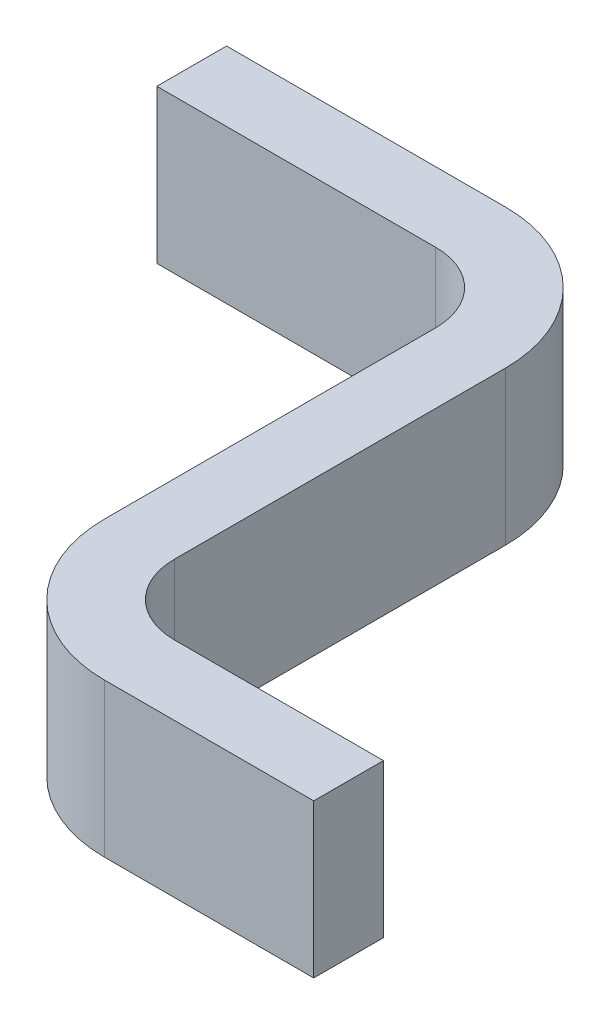
ISO-10303-21;
HEADER;
FILE_DESCRIPTION(('STEP AP214'),'2;1');
FILE_NAME('part.step','',(''),(''),'','','');
FILE_SCHEMA(('AUTOMOTIVE_DESIGN { 1 0 10303 214 1 1 1 1 }'));
ENDSEC;
DATA;
#1=APPLICATION_CONTEXT('core data for automotive mechanical design processes');
#2=APPLICATION_PROTOCOL_DEFINITION('international standard','automotive_design',2000,#1);
#3=PRODUCT_CONTEXT('',#1,'mechanical');
#4=PRODUCT('Part','Part','',(#3));
#5=PRODUCT_RELATED_PRODUCT_CATEGORY('part','',(#4));
#6=PRODUCT_DEFINITION_FORMATION('','',#4);
#7=PRODUCT_DEFINITION_CONTEXT('part definition',#1,'design');
#8=PRODUCT_DEFINITION('design','',#6,#7);
#9=PRODUCT_DEFINITION_SHAPE('','',#8);
#10=(LENGTH_UNIT() NAMED_UNIT(*) SI_UNIT(.MILLI.,.METRE.));
#11=(NAMED_UNIT(*) PLANE_ANGLE_UNIT() SI_UNIT($,.RADIAN.));
#12=(NAMED_UNIT(*) SI_UNIT($,.STERADIAN.) SOLID_ANGLE_UNIT());
#13=UNCERTAINTY_MEASURE_WITH_UNIT(LENGTH_MEASURE(1.E-05),#10,'distance_accuracy_value','');
#14=(GEOMETRIC_REPRESENTATION_CONTEXT(3) GLOBAL_UNCERTAINTY_ASSIGNED_CONTEXT((#13)) GLOBAL_UNIT_ASSIGNED_CONTEXT((#10,
#11,#12)) REPRESENTATION_CONTEXT('',''));
#15=CARTESIAN_POINT('',(0.,0.,0.));
#16=DIRECTION('',(0.,0.,1.));
#17=DIRECTION('',(1.,0.,0.));
#18=AXIS2_PLACEMENT_3D('',#15,#16,#17);
#19=CARTESIAN_POINT('',(-4.,-2.64,0.675));
#20=DIRECTION('',(0.,-1.,0.));
#21=DIRECTION('',(1.,0.,0.));
#22=AXIS2_PLACEMENT_3D('',#19,#20,#21);
#23=PLANE('',#22);
#24=CARTESIAN_POINT('',(-3.80000000000001,-2.64000000000001,0.675));
#25=DIRECTION('',(0.,1.,0.));
#26=DIRECTION('',(-1.,0.,0.));
#27=AXIS2_PLACEMENT_3D('',#24,#25,#26);
#28=CIRCLE('',#27,0.2);
#29=CARTESIAN_POINT('',(-3.80000000000001,-2.64000000000001,0.875));
#30=VERTEX_POINT('',#29);
#31=CARTESIAN_POINT('',(-4.,-2.64,0.675));
#32=VERTEX_POINT('',#31);
#33=EDGE_CURVE('E150',#30,#32,#28,.F.);
#34=ORIENTED_EDGE('',*,*,#33,.F.);
#35=DIRECTION('',(-1.,0.,0.));
#36=VECTOR('',#35,1.);
#37=CARTESIAN_POINT('',(-3.5,-2.64,0.875));
#38=LINE('',#37,#36);
#39=CARTESIAN_POINT('',(-3.5,-2.64,0.875));
#40=VERTEX_POINT('',#39);
#41=EDGE_CURVE('E147',#30,#40,#38,.F.);
#42=ORIENTED_EDGE('',*,*,#41,.T.);
#43=DIRECTION('',(0.,0.,1.));
#44=VECTOR('',#43,1.);
#45=CARTESIAN_POINT('',(-3.5,-2.64,0.775));
#46=LINE('',#45,#44);
#47=CARTESIAN_POINT('',(-3.5,-2.64,0.775));
#48=VERTEX_POINT('',#47);
#49=EDGE_CURVE('E141',#48,#40,#46,.T.);
#50=ORIENTED_EDGE('',*,*,#49,.F.);
#51=DIRECTION('',(1.,0.,0.));
#52=VECTOR('',#51,1.);
#53=CARTESIAN_POINT('',(-3.5,-2.64,0.775));
#54=LINE('',#53,#52);
#55=CARTESIAN_POINT('',(-3.80000000000001,-2.64000000000001,0.775));
#56=VERTEX_POINT('',#55);
#57=EDGE_CURVE('E115',#48,#56,#54,.F.);
#58=ORIENTED_EDGE('',*,*,#57,.T.);
#59=CARTESIAN_POINT('',(-3.80000000000001,-2.64000000000001,0.675));
#60=DIRECTION('',(0.,1.,0.));
#61=DIRECTION('',(-1.,0.,0.));
#62=AXIS2_PLACEMENT_3D('',#59,#60,#61);
#63=CIRCLE('',#62,0.1);
#64=CARTESIAN_POINT('',(-3.9,-2.64,0.675));
#65=VERTEX_POINT('',#64);
#66=EDGE_CURVE('E215',#56,#65,#63,.F.);
#67=ORIENTED_EDGE('',*,*,#66,.T.);
#68=DIRECTION('',(0.,0.,1.));
#69=VECTOR('',#68,1.);
#70=CARTESIAN_POINT('',(-3.9,-2.64,0.675));
#71=LINE('',#70,#69);
#72=CARTESIAN_POINT('',(-3.9,-2.64,0.2));
#73=VERTEX_POINT('',#72);
#74=EDGE_CURVE('E181',#65,#73,#71,.F.);
#75=ORIENTED_EDGE('',*,*,#74,.T.);
#76=CARTESIAN_POINT('',(-4.1,-2.64,0.2));
#77=DIRECTION('',(0.,-1.,0.));
#78=DIRECTION('',(1.,0.,0.));
#79=AXIS2_PLACEMENT_3D('',#76,#77,#78);
#80=CIRCLE('',#79,0.2);
#81=CARTESIAN_POINT('',(-4.1,-2.64,0.));
#82=VERTEX_POINT('',#81);
#83=EDGE_CURVE('E20',#82,#73,#80,.T.);
#84=ORIENTED_EDGE('',*,*,#83,.F.);
#85=DIRECTION('',(1.,0.,0.));
#86=VECTOR('',#85,1.);
#87=CARTESIAN_POINT('',(-4.1,-2.64,0.));
#88=LINE('',#87,#86);
#89=CARTESIAN_POINT('',(-4.5,-2.64,0.));
#90=VERTEX_POINT('',#89);
#91=EDGE_CURVE('E91',#82,#90,#88,.F.);
#92=ORIENTED_EDGE('',*,*,#91,.T.);
#93=DIRECTION('',(0.,0.,1.));
#94=VECTOR('',#93,1.);
#95=CARTESIAN_POINT('',(-4.5,-2.64,0.));
#96=LINE('',#95,#94);
#97=CARTESIAN_POINT('',(-4.5,-2.64,0.1));
#98=VERTEX_POINT('',#97);
#99=EDGE_CURVE('E163',#90,#98,#96,.T.);
#100=ORIENTED_EDGE('',*,*,#99,.T.);
#101=DIRECTION('',(-1.,0.,0.));
#102=VECTOR('',#101,1.);
#103=CARTESIAN_POINT('',(-4.1,-2.64,0.1));
#104=LINE('',#103,#102);
#105=CARTESIAN_POINT('',(-4.1,-2.64,0.1));
#106=VERTEX_POINT('',#105);
#107=EDGE_CURVE('E159',#98,#106,#104,.F.);
#108=ORIENTED_EDGE('',*,*,#107,.T.);
#109=CARTESIAN_POINT('',(-4.1,-2.64,0.2));
#110=DIRECTION('',(0.,-1.,0.));
#111=DIRECTION('',(1.,0.,0.));
#112=AXIS2_PLACEMENT_3D('',#109,#110,#111);
#113=CIRCLE('',#112,0.1);
#114=CARTESIAN_POINT('',(-4.,-2.64,0.2));
#115=VERTEX_POINT('',#114);
#116=EDGE_CURVE('E155',#106,#115,#113,.T.);
#117=ORIENTED_EDGE('',*,*,#116,.T.);
#118=DIRECTION('',(0.,0.,1.));
#119=VECTOR('',#118,1.);
#120=CARTESIAN_POINT('',(-4.,-2.64,0.675));
#121=LINE('',#120,#119);
#122=EDGE_CURVE('E154',#115,#32,#121,.T.);
#123=ORIENTED_EDGE('',*,*,#122,.T.);
#124=EDGE_LOOP('',(#34,#42,#50,#58,#67,#75,#84,#92,#100,#108,#117,#123));
#125=FACE_BOUND('',#124,.T.);
#126=ADVANCED_FACE('F17',(#125),#23,.F.);
#127=CARTESIAN_POINT('',(-4.1,-2.64,0.2));
#128=DIRECTION('',(0.,-1.,0.));
#129=DIRECTION('',(1.,0.,0.));
#130=AXIS2_PLACEMENT_3D('',#127,#128,#129);
#131=CYLINDRICAL_SURFACE('',#130,0.2);
#132=CARTESIAN_POINT('',(-4.1,-2.86,0.2));
#133=DIRECTION('',(0.,-1.,0.));
#134=DIRECTION('',(1.,0.,0.));
#135=AXIS2_PLACEMENT_3D('',#132,#133,#134);
#136=CIRCLE('',#135,0.2);
#137=CARTESIAN_POINT('',(-3.9,-2.86,0.2));
#138=VERTEX_POINT('',#137);
#139=CARTESIAN_POINT('',(-4.1,-2.86,0.));
#140=VERTEX_POINT('',#139);
#141=EDGE_CURVE('E183',#138,#140,#136,.F.);
#142=ORIENTED_EDGE('',*,*,#141,.T.);
#143=DIRECTION('',(0.,1.,0.));
#144=VECTOR('',#143,1.);
#145=CARTESIAN_POINT('',(-4.1,-2.64,0.));
#146=LINE('',#145,#144);
#147=EDGE_CURVE('E178',#140,#82,#146,.T.);
#148=ORIENTED_EDGE('',*,*,#147,.T.);
#149=ORIENTED_EDGE('',*,*,#83,.T.);
#150=DIRECTION('',(0.,-1.,0.));
#151=VECTOR('',#150,1.);
#152=CARTESIAN_POINT('',(-3.9,-2.64,0.2));
#153=LINE('',#152,#151);
#154=EDGE_CURVE('E217',#73,#138,#153,.T.);
#155=ORIENTED_EDGE('',*,*,#154,.T.);
#156=EDGE_LOOP('',(#142,#148,#149,#155));
#157=FACE_BOUND('',#156,.T.);
#158=ADVANCED_FACE('F254',(#157),#131,.T.);
#159=CARTESIAN_POINT('',(-4.1,-2.64,0.));
#160=DIRECTION('',(0.,0.,1.));
#161=DIRECTION('',(1.,0.,0.));
#162=AXIS2_PLACEMENT_3D('',#159,#160,#161);
#163=PLANE('',#162);
#164=ORIENTED_EDGE('',*,*,#147,.F.);
#165=DIRECTION('',(-1.,0.,0.));
#166=VECTOR('',#165,1.);
#167=CARTESIAN_POINT('',(-3.9,-2.86,0.));
#168=LINE('',#167,#166);
#169=CARTESIAN_POINT('',(-4.5,-2.86,0.));
#170=VERTEX_POINT('',#169);
#171=EDGE_CURVE('E170',#140,#170,#168,.T.);
#172=ORIENTED_EDGE('',*,*,#171,.T.);
#173=DIRECTION('',(0.,1.,0.));
#174=VECTOR('',#173,1.);
#175=CARTESIAN_POINT('',(-4.5,-2.64,0.));
#176=LINE('',#175,#174);
#177=EDGE_CURVE('E173',#170,#90,#176,.T.);
#178=ORIENTED_EDGE('',*,*,#177,.T.);
#179=ORIENTED_EDGE('',*,*,#91,.F.);
#180=EDGE_LOOP('',(#164,#172,#178,#179));
#181=FACE_BOUND('',#180,.T.);
#182=ADVANCED_FACE('F257',(#181),#163,.F.);
#183=CARTESIAN_POINT('',(-4.5,-2.64,0.));
#184=DIRECTION('',(1.,0.,0.));
#185=DIRECTION('',(0.,1.,0.));
#186=AXIS2_PLACEMENT_3D('',#183,#184,#185);
#187=PLANE('',#186);
#188=DIRECTION('',(0.,1.,0.));
#189=VECTOR('',#188,1.);
#190=CARTESIAN_POINT('',(-4.5,-2.86,0.1));
#191=LINE('',#190,#189);
#192=CARTESIAN_POINT('',(-4.5,-2.86,0.1));
#193=VERTEX_POINT('',#192);
#194=EDGE_CURVE('E160',#193,#98,#191,.T.);
#195=ORIENTED_EDGE('',*,*,#194,.T.);
#196=ORIENTED_EDGE('',*,*,#99,.F.);
#197=ORIENTED_EDGE('',*,*,#177,.F.);
#198=DIRECTION('',(0.,0.,1.));
#199=VECTOR('',#198,1.);
#200=CARTESIAN_POINT('',(-4.5,-2.86,0.675));
#201=LINE('',#200,#199);
#202=EDGE_CURVE('E166',#170,#193,#201,.T.);
#203=ORIENTED_EDGE('',*,*,#202,.T.);
#204=EDGE_LOOP('',(#195,#196,#197,#203));
#205=FACE_BOUND('',#204,.T.);
#206=ADVANCED_FACE('F259',(#205),#187,.F.);
#207=CARTESIAN_POINT('',(-4.1,-2.86,0.1));
#208=DIRECTION('',(0.,0.,-1.));
#209=DIRECTION('',(-1.,0.,0.));
#210=AXIS2_PLACEMENT_3D('',#207,#208,#209);
#211=PLANE('',#210);
#212=DIRECTION('',(0.,-1.,0.));
#213=VECTOR('',#212,1.);
#214=CARTESIAN_POINT('',(-4.1,-2.86,0.1));
#215=LINE('',#214,#213);
#216=CARTESIAN_POINT('',(-4.1,-2.86,0.1));
#217=VERTEX_POINT('',#216);
#218=EDGE_CURVE('E156',#217,#106,#215,.F.);
#219=ORIENTED_EDGE('',*,*,#218,.T.);
#220=ORIENTED_EDGE('',*,*,#107,.F.);
#221=ORIENTED_EDGE('',*,*,#194,.F.);
#222=DIRECTION('',(-1.,0.,0.));
#223=VECTOR('',#222,1.);
#224=CARTESIAN_POINT('',(-3.9,-2.86,0.1));
#225=LINE('',#224,#223);
#226=EDGE_CURVE('E169',#193,#217,#225,.F.);
#227=ORIENTED_EDGE('',*,*,#226,.T.);
#228=EDGE_LOOP('',(#219,#220,#221,#227));
#229=FACE_BOUND('',#228,.T.);
#230=ADVANCED_FACE('F234',(#229),#211,.F.);
#231=CARTESIAN_POINT('',(-4.1,-2.86,0.2));
#232=DIRECTION('',(0.,-1.,0.));
#233=DIRECTION('',(1.,0.,0.));
#234=AXIS2_PLACEMENT_3D('',#231,#232,#233);
#235=CYLINDRICAL_SURFACE('',#234,0.1);
#236=DIRECTION('',(0.,1.,0.));
#237=VECTOR('',#236,1.);
#238=CARTESIAN_POINT('',(-4.,-2.86,0.2));
#239=LINE('',#238,#237);
#240=CARTESIAN_POINT('',(-4.,-2.86,0.2));
#241=VERTEX_POINT('',#240);
#242=EDGE_CURVE('E151',#241,#115,#239,.T.);
#243=ORIENTED_EDGE('',*,*,#242,.T.);
#244=ORIENTED_EDGE('',*,*,#116,.F.);
#245=ORIENTED_EDGE('',*,*,#218,.F.);
#246=CARTESIAN_POINT('',(-4.1,-2.86,0.2));
#247=DIRECTION('',(0.,-1.,0.));
#248=DIRECTION('',(1.,0.,0.));
#249=AXIS2_PLACEMENT_3D('',#246,#247,#248);
#250=CIRCLE('',#249,0.1);
#251=EDGE_CURVE('E210',#217,#241,#250,.T.);
#252=ORIENTED_EDGE('',*,*,#251,.T.);
#253=EDGE_LOOP('',(#243,#244,#245,#252));
#254=FACE_BOUND('',#253,.T.);
#255=ADVANCED_FACE('F227',(#254),#235,.F.);
#256=CARTESIAN_POINT('',(-4.,-2.86,0.675));
#257=DIRECTION('',(1.,0.,0.));
#258=DIRECTION('',(0.,1.,0.));
#259=AXIS2_PLACEMENT_3D('',#256,#257,#258);
#260=PLANE('',#259);
#261=DIRECTION('',(0.,1.,0.));
#262=VECTOR('',#261,1.);
#263=CARTESIAN_POINT('',(-4.,-2.86,0.675));
#264=LINE('',#263,#262);
#265=CARTESIAN_POINT('',(-4.,-2.86,0.675));
#266=VERTEX_POINT('',#265);
#267=EDGE_CURVE('E148',#32,#266,#264,.F.);
#268=ORIENTED_EDGE('',*,*,#267,.F.);
#269=ORIENTED_EDGE('',*,*,#122,.F.);
#270=ORIENTED_EDGE('',*,*,#242,.F.);
#271=DIRECTION('',(0.,0.,1.));
#272=VECTOR('',#271,1.);
#273=CARTESIAN_POINT('',(-4.,-2.86,0.675));
#274=LINE('',#273,#272);
#275=EDGE_CURVE('E209',#241,#266,#274,.T.);
#276=ORIENTED_EDGE('',*,*,#275,.T.);
#277=EDGE_LOOP('',(#268,#269,#270,#276));
#278=FACE_BOUND('',#277,.T.);
#279=ADVANCED_FACE('F224',(#278),#260,.F.);
#280=CARTESIAN_POINT('',(-3.8,-2.86,0.675));
#281=DIRECTION('',(0.,1.,0.));
#282=DIRECTION('',(-1.,0.,0.));
#283=AXIS2_PLACEMENT_3D('',#280,#281,#282);
#284=CYLINDRICAL_SURFACE('',#283,0.2);
#285=ORIENTED_EDGE('',*,*,#33,.T.);
#286=ORIENTED_EDGE('',*,*,#267,.T.);
#287=CARTESIAN_POINT('',(-3.8,-2.86,0.675));
#288=DIRECTION('',(0.,1.,0.));
#289=DIRECTION('',(-1.,0.,0.));
#290=AXIS2_PLACEMENT_3D('',#287,#288,#289);
#291=CIRCLE('',#290,0.2);
#292=CARTESIAN_POINT('',(-3.8,-2.86,0.875));
#293=VERTEX_POINT('',#292);
#294=EDGE_CURVE('E133',#266,#293,#291,.T.);
#295=ORIENTED_EDGE('',*,*,#294,.T.);
#296=DIRECTION('',(0.,1.,0.));
#297=VECTOR('',#296,1.);
#298=CARTESIAN_POINT('',(-3.8,-2.86,0.875));
#299=LINE('',#298,#297);
#300=EDGE_CURVE('E144',#293,#30,#299,.T.);
#301=ORIENTED_EDGE('',*,*,#300,.T.);
#302=EDGE_LOOP('',(#285,#286,#295,#301));
#303=FACE_BOUND('',#302,.T.);
#304=ADVANCED_FACE('F285',(#303),#284,.T.);
#305=CARTESIAN_POINT('',(-3.5,-2.86,0.875));
#306=DIRECTION('',(0.,0.,-1.));
#307=DIRECTION('',(-1.,0.,0.));
#308=AXIS2_PLACEMENT_3D('',#305,#306,#307);
#309=PLANE('',#308);
#310=DIRECTION('',(0.,1.,0.));
#311=VECTOR('',#310,1.);
#312=CARTESIAN_POINT('',(-3.5,-2.64,0.875));
#313=LINE('',#312,#311);
#314=CARTESIAN_POINT('',(-3.5,-2.86,0.875));
#315=VERTEX_POINT('',#314);
#316=EDGE_CURVE('E118',#40,#315,#313,.F.);
#317=ORIENTED_EDGE('',*,*,#316,.F.);
#318=ORIENTED_EDGE('',*,*,#41,.F.);
#319=ORIENTED_EDGE('',*,*,#300,.F.);
#320=DIRECTION('',(-1.,0.,0.));
#321=VECTOR('',#320,1.);
#322=CARTESIAN_POINT('',(-3.9,-2.86,0.875));
#323=LINE('',#322,#321);
#324=EDGE_CURVE('E131',#293,#315,#323,.F.);
#325=ORIENTED_EDGE('',*,*,#324,.T.);
#326=EDGE_LOOP('',(#317,#318,#319,#325));
#327=FACE_BOUND('',#326,.T.);
#328=ADVANCED_FACE('F282',(#327),#309,.F.);
#329=CARTESIAN_POINT('',(-3.5,-2.64,0.775));
#330=DIRECTION('',(1.,0.,0.));
#331=DIRECTION('',(0.,1.,0.));
#332=AXIS2_PLACEMENT_3D('',#329,#330,#331);
#333=PLANE('',#332);
#334=ORIENTED_EDGE('',*,*,#49,.T.);
#335=ORIENTED_EDGE('',*,*,#316,.T.);
#336=DIRECTION('',(0.,0.,1.));
#337=VECTOR('',#336,1.);
#338=CARTESIAN_POINT('',(-3.5,-2.86,0.675));
#339=LINE('',#338,#337);
#340=CARTESIAN_POINT('',(-3.5,-2.86,0.775));
#341=VERTEX_POINT('',#340);
#342=EDGE_CURVE('E125',#315,#341,#339,.F.);
#343=ORIENTED_EDGE('',*,*,#342,.T.);
#344=DIRECTION('',(0.,1.,0.));
#345=VECTOR('',#344,1.);
#346=CARTESIAN_POINT('',(-3.5,-2.64,0.775));
#347=LINE('',#346,#345);
#348=EDGE_CURVE('E110',#341,#48,#347,.T.);
#349=ORIENTED_EDGE('',*,*,#348,.T.);
#350=EDGE_LOOP('',(#334,#335,#343,#349));
#351=FACE_BOUND('',#350,.T.);
#352=ADVANCED_FACE('F129',(#351),#333,.T.);
#353=CARTESIAN_POINT('',(-3.5,-2.64,0.775));
#354=DIRECTION('',(0.,0.,1.));
#355=DIRECTION('',(1.,0.,0.));
#356=AXIS2_PLACEMENT_3D('',#353,#354,#355);
#357=PLANE('',#356);
#358=ORIENTED_EDGE('',*,*,#348,.F.);
#359=DIRECTION('',(-1.,0.,0.));
#360=VECTOR('',#359,1.);
#361=CARTESIAN_POINT('',(-3.9,-2.86,0.775));
#362=LINE('',#361,#360);
#363=CARTESIAN_POINT('',(-3.8,-2.86,0.775));
#364=VERTEX_POINT('',#363);
#365=EDGE_CURVE('E114',#341,#364,#362,.T.);
#366=ORIENTED_EDGE('',*,*,#365,.T.);
#367=DIRECTION('',(0.,1.,0.));
#368=VECTOR('',#367,1.);
#369=CARTESIAN_POINT('',(-3.80000000000001,-2.64000000000001,0.775));
#370=LINE('',#369,#368);
#371=EDGE_CURVE('E185',#364,#56,#370,.T.);
#372=ORIENTED_EDGE('',*,*,#371,.T.);
#373=ORIENTED_EDGE('',*,*,#57,.F.);
#374=EDGE_LOOP('',(#358,#366,#372,#373));
#375=FACE_BOUND('',#374,.T.);
#376=ADVANCED_FACE('F112',(#375),#357,.F.);
#377=CARTESIAN_POINT('',(-3.80000000000001,-2.64000000000001,0.675));
#378=DIRECTION('',(0.,1.,0.));
#379=DIRECTION('',(-1.,0.,0.));
#380=AXIS2_PLACEMENT_3D('',#377,#378,#379);
#381=CYLINDRICAL_SURFACE('',#380,0.1);
#382=ORIENTED_EDGE('',*,*,#371,.F.);
#383=CARTESIAN_POINT('',(-3.8,-2.86,0.675));
#384=DIRECTION('',(0.,1.,0.));
#385=DIRECTION('',(-1.,0.,0.));
#386=AXIS2_PLACEMENT_3D('',#383,#384,#385);
#387=CIRCLE('',#386,0.1);
#388=CARTESIAN_POINT('',(-3.9,-2.86,0.675));
#389=VERTEX_POINT('',#388);
#390=EDGE_CURVE('E26',#364,#389,#387,.F.);
#391=ORIENTED_EDGE('',*,*,#390,.T.);
#392=DIRECTION('',(0.,-1.,0.));
#393=VECTOR('',#392,1.);
#394=CARTESIAN_POINT('',(-3.9,-2.64,0.675));
#395=LINE('',#394,#393);
#396=EDGE_CURVE('E34',#389,#65,#395,.F.);
#397=ORIENTED_EDGE('',*,*,#396,.T.);
#398=ORIENTED_EDGE('',*,*,#66,.F.);
#399=EDGE_LOOP('',(#382,#391,#397,#398));
#400=FACE_BOUND('',#399,.T.);
#401=ADVANCED_FACE('F250',(#400),#381,.F.);
#402=CARTESIAN_POINT('',(-3.9,-2.64,0.675));
#403=DIRECTION('',(-1.,0.,0.));
#404=DIRECTION('',(0.,-1.,0.));
#405=AXIS2_PLACEMENT_3D('',#402,#403,#404);
#406=PLANE('',#405);
#407=ORIENTED_EDGE('',*,*,#396,.F.);
#408=DIRECTION('',(0.,0.,1.));
#409=VECTOR('',#408,1.);
#410=CARTESIAN_POINT('',(-3.9,-2.86,0.675));
#411=LINE('',#410,#409);
#412=EDGE_CURVE('E11',#389,#138,#411,.F.);
#413=ORIENTED_EDGE('',*,*,#412,.T.);
#414=ORIENTED_EDGE('',*,*,#154,.F.);
#415=ORIENTED_EDGE('',*,*,#74,.F.);
#416=EDGE_LOOP('',(#407,#413,#414,#415));
#417=FACE_BOUND('',#416,.T.);
#418=ADVANCED_FACE('F252',(#417),#406,.F.);
#419=CARTESIAN_POINT('',(-3.9,-2.86,0.675));
#420=DIRECTION('',(0.,1.,0.));
#421=DIRECTION('',(-1.,0.,0.));
#422=AXIS2_PLACEMENT_3D('',#419,#420,#421);
#423=PLANE('',#422);
#424=ORIENTED_EDGE('',*,*,#390,.F.);
#425=ORIENTED_EDGE('',*,*,#365,.F.);
#426=ORIENTED_EDGE('',*,*,#342,.F.);
#427=ORIENTED_EDGE('',*,*,#324,.F.);
#428=ORIENTED_EDGE('',*,*,#294,.F.);
#429=ORIENTED_EDGE('',*,*,#275,.F.);
#430=ORIENTED_EDGE('',*,*,#251,.F.);
#431=ORIENTED_EDGE('',*,*,#226,.F.);
#432=ORIENTED_EDGE('',*,*,#202,.F.);
#433=ORIENTED_EDGE('',*,*,#171,.F.);
#434=ORIENTED_EDGE('',*,*,#141,.F.);
#435=ORIENTED_EDGE('',*,*,#412,.F.);
#436=EDGE_LOOP('',(#424,#425,#426,#427,#428,#429,#430,#431,#432,#433,#434,#435));
#437=FACE_BOUND('',#436,.T.);
#438=ADVANCED_FACE('F123',(#437),#423,.F.);
#439=CLOSED_SHELL('',(#126,#158,#182,#206,#230,#255,#279,#304,#328,#352,#376,#401,#418,#438));
#440=MANIFOLD_SOLID_BREP('B1',#439);
#441=ADVANCED_BREP_SHAPE_REPRESENTATION('',(#18,#440),#14);
#442=SHAPE_DEFINITION_REPRESENTATION(#9,#441);
ENDSEC;
END-ISO-10303-21;
